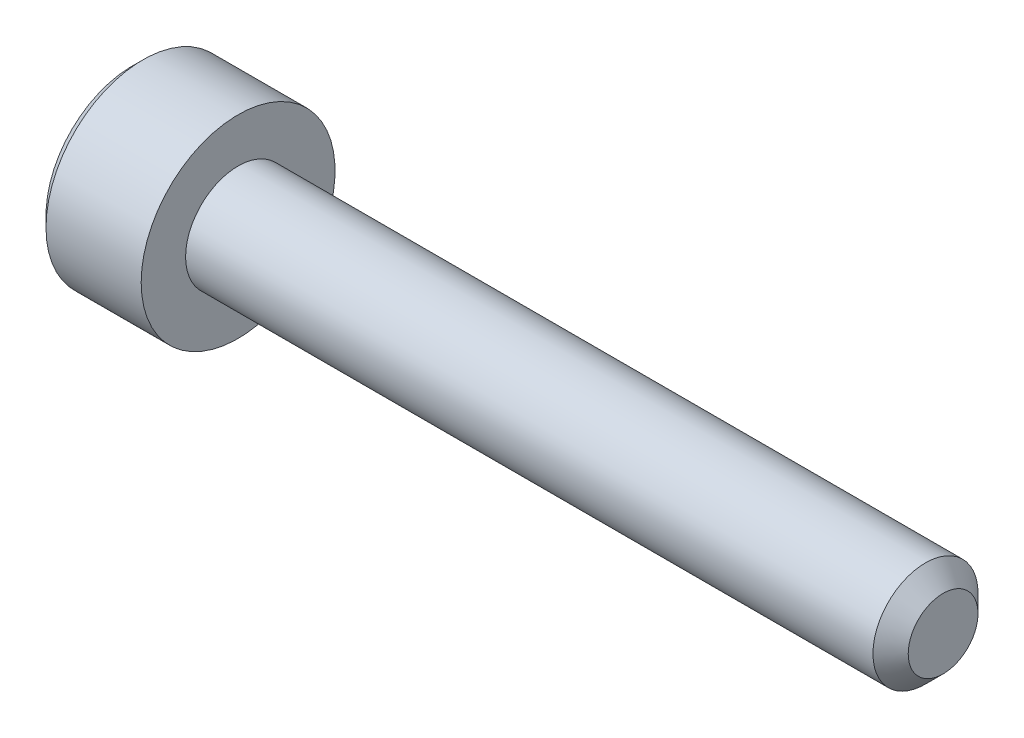
ISO-10303-21;
HEADER;
FILE_DESCRIPTION(('STEP AP214'),'2;1');
FILE_NAME('part.step','',(''),(''),'','','');
FILE_SCHEMA(('AUTOMOTIVE_DESIGN { 1 0 10303 214 1 1 1 1 }'));
ENDSEC;
DATA;
#1=APPLICATION_CONTEXT('core data for automotive mechanical design processes');
#2=APPLICATION_PROTOCOL_DEFINITION('international standard','automotive_design',2000,#1);
#3=PRODUCT_CONTEXT('',#1,'mechanical');
#4=PRODUCT('Part','Part','',(#3));
#5=PRODUCT_RELATED_PRODUCT_CATEGORY('part','',(#4));
#6=PRODUCT_DEFINITION_FORMATION('','',#4);
#7=PRODUCT_DEFINITION_CONTEXT('part definition',#1,'design');
#8=PRODUCT_DEFINITION('design','',#6,#7);
#9=PRODUCT_DEFINITION_SHAPE('','',#8);
#10=(LENGTH_UNIT() NAMED_UNIT(*) SI_UNIT(.MILLI.,.METRE.));
#11=(NAMED_UNIT(*) PLANE_ANGLE_UNIT() SI_UNIT($,.RADIAN.));
#12=(NAMED_UNIT(*) SI_UNIT($,.STERADIAN.) SOLID_ANGLE_UNIT());
#13=UNCERTAINTY_MEASURE_WITH_UNIT(LENGTH_MEASURE(1.E-05),#10,'distance_accuracy_value','');
#14=(GEOMETRIC_REPRESENTATION_CONTEXT(3) GLOBAL_UNCERTAINTY_ASSIGNED_CONTEXT((#13)) GLOBAL_UNIT_ASSIGNED_CONTEXT((#10,
#11,#12)) REPRESENTATION_CONTEXT('',''));
#15=CARTESIAN_POINT('',(0.,0.,0.));
#16=DIRECTION('',(0.,0.,1.));
#17=DIRECTION('',(1.,0.,0.));
#18=AXIS2_PLACEMENT_3D('',#15,#16,#17);
#19=CARTESIAN_POINT('',(0.,0.,0.));
#20=DIRECTION('',(1.,0.,0.));
#21=DIRECTION('',(0.,0.,-1.));
#22=AXIS2_PLACEMENT_3D('',#19,#20,#21);
#23=PLANE('',#22);
#24=DIRECTION('',(0.,0.866025403784439,0.5));
#25=VECTOR('',#24,1.);
#26=CARTESIAN_POINT('',(0.,1.4,-0.981495457622363));
#27=LINE('',#26,#25);
#28=CARTESIAN_POINT('',(0.,0.,-1.78978583448784));
#29=VERTEX_POINT('',#28);
#30=CARTESIAN_POINT('',(0.,1.55,-0.894892917243919));
#31=VERTEX_POINT('',#30);
#32=EDGE_CURVE('E153',#29,#31,#27,.T.);
#33=ORIENTED_EDGE('',*,*,#32,.T.);
#34=DIRECTION('',(0.,0.,1.));
#35=VECTOR('',#34,1.);
#36=CARTESIAN_POINT('',(0.,1.55,0.721687836487032));
#37=LINE('',#36,#35);
#38=CARTESIAN_POINT('',(0.,1.55,0.894892917243921));
#39=VERTEX_POINT('',#38);
#40=EDGE_CURVE('E163',#31,#39,#37,.T.);
#41=ORIENTED_EDGE('',*,*,#40,.T.);
#42=DIRECTION('',(0.,-0.866025403784439,0.5));
#43=VECTOR('',#42,1.);
#44=CARTESIAN_POINT('',(0.,0.150000000000001,1.7031832941094));
#45=LINE('',#44,#43);
#46=CARTESIAN_POINT('',(0.,0.,1.78978583448784));
#47=VERTEX_POINT('',#46);
#48=EDGE_CURVE('E161',#39,#47,#45,.T.);
#49=ORIENTED_EDGE('',*,*,#48,.T.);
#50=DIRECTION('',(0.,-0.866025403784439,-0.5));
#51=VECTOR('',#50,1.);
#52=CARTESIAN_POINT('',(0.,-1.4,0.981495457622366));
#53=LINE('',#52,#51);
#54=CARTESIAN_POINT('',(0.,-1.55,0.894892917243921));
#55=VERTEX_POINT('',#54);
#56=EDGE_CURVE('E159',#47,#55,#53,.T.);
#57=ORIENTED_EDGE('',*,*,#56,.T.);
#58=DIRECTION('',(0.,0.,-1.));
#59=VECTOR('',#58,1.);
#60=CARTESIAN_POINT('',(0.,-1.55,-0.721687836487031));
#61=LINE('',#60,#59);
#62=CARTESIAN_POINT('',(0.,-1.55,-0.89489291724392));
#63=VERTEX_POINT('',#62);
#64=EDGE_CURVE('E157',#55,#63,#61,.T.);
#65=ORIENTED_EDGE('',*,*,#64,.T.);
#66=DIRECTION('',(0.,0.866025403784439,-0.5));
#67=VECTOR('',#66,1.);
#68=CARTESIAN_POINT('',(0.,-0.15,-1.7031832941094));
#69=LINE('',#68,#67);
#70=EDGE_CURVE('E155',#63,#29,#69,.T.);
#71=ORIENTED_EDGE('',*,*,#70,.T.);
#72=EDGE_LOOP('',(#33,#41,#49,#57,#65,#71));
#73=FACE_BOUND('',#72,.T.);
#74=CARTESIAN_POINT('',(0.,0.,0.));
#75=DIRECTION('',(1.,0.,0.));
#76=DIRECTION('',(0.,0.,-1.));
#77=AXIS2_PLACEMENT_3D('',#74,#75,#76);
#78=CIRCLE('',#77,2.45);
#79=CARTESIAN_POINT('',(0.,0.,-2.45));
#80=VERTEX_POINT('',#79);
#81=EDGE_CURVE('E147',#80,#80,#78,.F.);
#82=ORIENTED_EDGE('',*,*,#81,.T.);
#83=EDGE_LOOP('',(#82));
#84=FACE_BOUND('',#83,.T.);
#85=ADVANCED_FACE('F32',(#73,#84),#23,.F.);
#86=CARTESIAN_POINT('',(23.,0.,0.));
#87=DIRECTION('',(-1.,0.,0.));
#88=DIRECTION('',(0.,0.,1.));
#89=AXIS2_PLACEMENT_3D('',#86,#87,#88);
#90=PLANE('',#89);
#91=CARTESIAN_POINT('',(23.,0.,0.));
#92=DIRECTION('',(-1.,0.,0.));
#93=DIRECTION('',(0.,0.,1.));
#94=AXIS2_PLACEMENT_3D('',#91,#92,#93);
#95=CIRCLE('',#94,0.989999999999991);
#96=CARTESIAN_POINT('',(23.,0.,0.989999999999991));
#97=VERTEX_POINT('',#96);
#98=EDGE_CURVE('E144',#97,#97,#95,.F.);
#99=ORIENTED_EDGE('',*,*,#98,.T.);
#100=EDGE_LOOP('',(#99));
#101=FACE_BOUND('',#100,.T.);
#102=ADVANCED_FACE('F243',(#101),#90,.F.);
#103=CARTESIAN_POINT('',(-88.7054908485857,0.,0.));
#104=DIRECTION('',(-1.,0.,0.));
#105=DIRECTION('',(0.,0.,1.));
#106=AXIS2_PLACEMENT_3D('',#103,#104,#105);
#107=CYLINDRICAL_SURFACE('',#106,1.49);
#108=CARTESIAN_POINT('',(22.5,0.,0.));
#109=DIRECTION('',(-1.,0.,0.));
#110=DIRECTION('',(0.,0.,1.));
#111=AXIS2_PLACEMENT_3D('',#108,#109,#110);
#112=CIRCLE('',#111,1.49);
#113=CARTESIAN_POINT('',(22.5,0.,1.49));
#114=VERTEX_POINT('',#113);
#115=EDGE_CURVE('E141',#114,#114,#112,.T.);
#116=ORIENTED_EDGE('',*,*,#115,.T.);
#117=EDGE_LOOP('',(#116));
#118=FACE_BOUND('',#117,.T.);
#119=CARTESIAN_POINT('',(3.,0.,0.));
#120=DIRECTION('',(-1.,0.,0.));
#121=DIRECTION('',(0.,0.,1.));
#122=AXIS2_PLACEMENT_3D('',#119,#120,#121);
#123=CIRCLE('',#122,1.49);
#124=CARTESIAN_POINT('',(3.,0.,1.49));
#125=VERTEX_POINT('',#124);
#126=EDGE_CURVE('E133',#125,#125,#123,.T.);
#127=ORIENTED_EDGE('',*,*,#126,.F.);
#128=EDGE_LOOP('',(#127));
#129=FACE_BOUND('',#128,.T.);
#130=ADVANCED_FACE('F248',(#118,#129),#107,.T.);
#131=CARTESIAN_POINT('',(3.,1.49,0.));
#132=DIRECTION('',(-1.,0.,0.));
#133=DIRECTION('',(0.,0.,1.));
#134=AXIS2_PLACEMENT_3D('',#131,#132,#133);
#135=PLANE('',#134);
#136=CARTESIAN_POINT('',(3.,0.,0.));
#137=DIRECTION('',(-1.,0.,0.));
#138=DIRECTION('',(0.,0.,1.));
#139=AXIS2_PLACEMENT_3D('',#136,#137,#138);
#140=CIRCLE('',#139,2.75);
#141=CARTESIAN_POINT('',(3.,0.,2.75));
#142=VERTEX_POINT('',#141);
#143=EDGE_CURVE('E129',#142,#142,#140,.T.);
#144=ORIENTED_EDGE('',*,*,#143,.F.);
#145=EDGE_LOOP('',(#144));
#146=FACE_BOUND('',#145,.T.);
#147=ORIENTED_EDGE('',*,*,#126,.T.);
#148=EDGE_LOOP('',(#147));
#149=FACE_BOUND('',#148,.T.);
#150=ADVANCED_FACE('F258',(#146,#149),#135,.F.);
#151=CARTESIAN_POINT('',(-88.7054908485857,0.,0.));
#152=DIRECTION('',(-1.,0.,0.));
#153=DIRECTION('',(0.,0.,1.));
#154=AXIS2_PLACEMENT_3D('',#151,#152,#153);
#155=CYLINDRICAL_SURFACE('',#154,2.75);
#156=CARTESIAN_POINT('',(0.300000000000009,0.,0.));
#157=DIRECTION('',(1.,0.,0.));
#158=DIRECTION('',(0.,0.,-1.));
#159=AXIS2_PLACEMENT_3D('',#156,#157,#158);
#160=CIRCLE('',#159,2.75);
#161=CARTESIAN_POINT('',(0.300000000000009,0.,-2.75));
#162=VERTEX_POINT('',#161);
#163=EDGE_CURVE('E150',#162,#162,#160,.T.);
#164=ORIENTED_EDGE('',*,*,#163,.T.);
#165=EDGE_LOOP('',(#164));
#166=FACE_BOUND('',#165,.T.);
#167=ORIENTED_EDGE('',*,*,#143,.T.);
#168=EDGE_LOOP('',(#167));
#169=FACE_BOUND('',#168,.T.);
#170=ADVANCED_FACE('F254',(#166,#169),#155,.T.);
#171=CARTESIAN_POINT('',(22.5,0.,0.));
#172=DIRECTION('',(-1.,0.,0.));
#173=DIRECTION('',(0.,0.,1.));
#174=AXIS2_PLACEMENT_3D('',#171,#172,#173);
#175=CONICAL_SURFACE('',#174,1.49,0.785398163397463);
#176=ORIENTED_EDGE('',*,*,#98,.F.);
#177=EDGE_LOOP('',(#176));
#178=FACE_BOUND('',#177,.T.);
#179=ORIENTED_EDGE('',*,*,#115,.F.);
#180=EDGE_LOOP('',(#179));
#181=FACE_BOUND('',#180,.T.);
#182=ADVANCED_FACE('F257',(#178,#181),#175,.T.);
#183=CARTESIAN_POINT('',(0.,0.,0.));
#184=DIRECTION('',(1.,0.,0.));
#185=DIRECTION('',(0.,0.,-1.));
#186=AXIS2_PLACEMENT_3D('',#183,#184,#185);
#187=CONICAL_SURFACE('',#186,2.45,0.785398163397438);
#188=ORIENTED_EDGE('',*,*,#163,.F.);
#189=EDGE_LOOP('',(#188));
#190=FACE_BOUND('',#189,.T.);
#191=ORIENTED_EDGE('',*,*,#81,.F.);
#192=EDGE_LOOP('',(#191));
#193=FACE_BOUND('',#192,.T.);
#194=ADVANCED_FACE('F268',(#190,#193),#187,.T.);
#195=CARTESIAN_POINT('',(2.5,1.25,0.721687836487032));
#196=DIRECTION('',(0.,-0.5,-0.866025403784438));
#197=DIRECTION('',(0.,0.866025403784439,-0.5));
#198=AXIS2_PLACEMENT_3D('',#195,#196,#197);
#199=PLANE('',#198);
#200=DIRECTION('',(-1.,0.,0.));
#201=VECTOR('',#200,1.);
#202=CARTESIAN_POINT('',(2.5,0.,1.44337567297407));
#203=LINE('',#202,#201);
#204=CARTESIAN_POINT('',(2.5,0.,1.44337567297407));
#205=VERTEX_POINT('',#204);
#206=CARTESIAN_POINT('',(0.299999999999998,0.,1.44337567297407));
#207=VERTEX_POINT('',#206);
#208=EDGE_CURVE('E121',#205,#207,#203,.T.);
#209=ORIENTED_EDGE('',*,*,#208,.T.);
#210=DIRECTION('',(0.,0.866025403784439,-0.5));
#211=VECTOR('',#210,1.);
#212=CARTESIAN_POINT('',(0.299999999999998,1.25,0.721687836487032));
#213=LINE('',#212,#211);
#214=CARTESIAN_POINT('',(0.299999999999998,1.25,0.721687836487032));
#215=VERTEX_POINT('',#214);
#216=EDGE_CURVE('E169',#207,#215,#213,.T.);
#217=ORIENTED_EDGE('',*,*,#216,.T.);
#218=DIRECTION('',(-1.,0.,0.));
#219=VECTOR('',#218,1.);
#220=CARTESIAN_POINT('',(2.5,1.25,0.721687836487032));
#221=LINE('',#220,#219);
#222=CARTESIAN_POINT('',(2.5,1.25,0.721687836487032));
#223=VERTEX_POINT('',#222);
#224=EDGE_CURVE('E124',#223,#215,#221,.T.);
#225=ORIENTED_EDGE('',*,*,#224,.F.);
#226=DIRECTION('',(0.,-0.866025403784439,0.5));
#227=VECTOR('',#226,1.);
#228=CARTESIAN_POINT('',(2.5,1.25,0.721687836487032));
#229=LINE('',#228,#227);
#230=EDGE_CURVE('E109',#223,#205,#229,.T.);
#231=ORIENTED_EDGE('',*,*,#230,.T.);
#232=EDGE_LOOP('',(#209,#217,#225,#231));
#233=FACE_BOUND('',#232,.T.);
#234=ADVANCED_FACE('F120',(#233),#199,.T.);
#235=CARTESIAN_POINT('',(2.5,0.,1.44337567297407));
#236=DIRECTION('',(0.,0.5,-0.866025403784438));
#237=DIRECTION('',(0.,0.866025403784439,0.5));
#238=AXIS2_PLACEMENT_3D('',#235,#236,#237);
#239=PLANE('',#238);
#240=DIRECTION('',(-1.,0.,0.));
#241=VECTOR('',#240,1.);
#242=CARTESIAN_POINT('',(2.5,-1.25,0.721687836487033));
#243=LINE('',#242,#241);
#244=CARTESIAN_POINT('',(2.5,-1.25,0.721687836487033));
#245=VERTEX_POINT('',#244);
#246=CARTESIAN_POINT('',(0.299999999999998,-1.25,0.721687836487033));
#247=VERTEX_POINT('',#246);
#248=EDGE_CURVE('E130',#245,#247,#243,.T.);
#249=ORIENTED_EDGE('',*,*,#248,.T.);
#250=DIRECTION('',(0.,0.866025403784439,0.5));
#251=VECTOR('',#250,1.);
#252=CARTESIAN_POINT('',(0.299999999999998,0.,1.44337567297407));
#253=LINE('',#252,#251);
#254=EDGE_CURVE('E128',#247,#207,#253,.T.);
#255=ORIENTED_EDGE('',*,*,#254,.T.);
#256=ORIENTED_EDGE('',*,*,#208,.F.);
#257=DIRECTION('',(0.,-0.866025403784439,-0.5));
#258=VECTOR('',#257,1.);
#259=CARTESIAN_POINT('',(2.5,0.,1.44337567297407));
#260=LINE('',#259,#258);
#261=EDGE_CURVE('E105',#205,#245,#260,.T.);
#262=ORIENTED_EDGE('',*,*,#261,.T.);
#263=EDGE_LOOP('',(#249,#255,#256,#262));
#264=FACE_BOUND('',#263,.T.);
#265=ADVANCED_FACE('F126',(#264),#239,.T.);
#266=CARTESIAN_POINT('',(2.5,-1.25,0.721687836487033));
#267=DIRECTION('',(0.,1.,0.));
#268=DIRECTION('',(0.,0.,1.));
#269=AXIS2_PLACEMENT_3D('',#266,#267,#268);
#270=PLANE('',#269);
#271=DIRECTION('',(-1.,0.,0.));
#272=VECTOR('',#271,1.);
#273=CARTESIAN_POINT('',(2.5,-1.25,-0.721687836487031));
#274=LINE('',#273,#272);
#275=CARTESIAN_POINT('',(2.5,-1.25,-0.721687836487031));
#276=VERTEX_POINT('',#275);
#277=CARTESIAN_POINT('',(0.299999999999998,-1.25,-0.721687836487031));
#278=VERTEX_POINT('',#277);
#279=EDGE_CURVE('E135',#276,#278,#274,.T.);
#280=ORIENTED_EDGE('',*,*,#279,.T.);
#281=DIRECTION('',(0.,0.,1.));
#282=VECTOR('',#281,1.);
#283=CARTESIAN_POINT('',(0.299999999999998,-1.25,0.721687836487033));
#284=LINE('',#283,#282);
#285=EDGE_CURVE('E172',#278,#247,#284,.T.);
#286=ORIENTED_EDGE('',*,*,#285,.T.);
#287=ORIENTED_EDGE('',*,*,#248,.F.);
#288=DIRECTION('',(0.,0.,-1.));
#289=VECTOR('',#288,1.);
#290=CARTESIAN_POINT('',(2.5,-1.25,0.721687836487033));
#291=LINE('',#290,#289);
#292=EDGE_CURVE('E111',#245,#276,#291,.T.);
#293=ORIENTED_EDGE('',*,*,#292,.T.);
#294=EDGE_LOOP('',(#280,#286,#287,#293));
#295=FACE_BOUND('',#294,.T.);
#296=ADVANCED_FACE('F199',(#295),#270,.T.);
#297=CARTESIAN_POINT('',(2.5,-1.25,-0.721687836487031));
#298=DIRECTION('',(0.,0.5,0.866025403784439));
#299=DIRECTION('',(0.,-0.866025403784439,0.5));
#300=AXIS2_PLACEMENT_3D('',#297,#298,#299);
#301=PLANE('',#300);
#302=DIRECTION('',(-1.,0.,0.));
#303=VECTOR('',#302,1.);
#304=CARTESIAN_POINT('',(2.5,0.,-1.44337567297406));
#305=LINE('',#304,#303);
#306=CARTESIAN_POINT('',(2.5,0.,-1.44337567297406));
#307=VERTEX_POINT('',#306);
#308=CARTESIAN_POINT('',(0.299999999999998,0.,-1.44337567297406));
#309=VERTEX_POINT('',#308);
#310=EDGE_CURVE('E200',#307,#309,#305,.T.);
#311=ORIENTED_EDGE('',*,*,#310,.T.);
#312=DIRECTION('',(0.,-0.866025403784439,0.5));
#313=VECTOR('',#312,1.);
#314=CARTESIAN_POINT('',(0.299999999999998,-1.25,-0.721687836487031));
#315=LINE('',#314,#313);
#316=EDGE_CURVE('E41',#309,#278,#315,.T.);
#317=ORIENTED_EDGE('',*,*,#316,.T.);
#318=ORIENTED_EDGE('',*,*,#279,.F.);
#319=DIRECTION('',(0.,0.866025403784439,-0.499999999999999));
#320=VECTOR('',#319,1.);
#321=CARTESIAN_POINT('',(2.5,-1.25,-0.721687836487031));
#322=LINE('',#321,#320);
#323=EDGE_CURVE('E210',#276,#307,#322,.T.);
#324=ORIENTED_EDGE('',*,*,#323,.T.);
#325=EDGE_LOOP('',(#311,#317,#318,#324));
#326=FACE_BOUND('',#325,.T.);
#327=ADVANCED_FACE('F212',(#326),#301,.T.);
#328=CARTESIAN_POINT('',(2.5,0.,-1.44337567297406));
#329=DIRECTION('',(0.,-0.5,0.866025403784439));
#330=DIRECTION('',(0.,-0.866025403784439,-0.5));
#331=AXIS2_PLACEMENT_3D('',#328,#329,#330);
#332=PLANE('',#331);
#333=DIRECTION('',(-1.,0.,0.));
#334=VECTOR('',#333,1.);
#335=CARTESIAN_POINT('',(2.5,1.25,-0.72168783648703));
#336=LINE('',#335,#334);
#337=CARTESIAN_POINT('',(2.5,1.25,-0.72168783648703));
#338=VERTEX_POINT('',#337);
#339=CARTESIAN_POINT('',(0.299999999999998,1.25,-0.72168783648703));
#340=VERTEX_POINT('',#339);
#341=EDGE_CURVE('E201',#338,#340,#336,.T.);
#342=ORIENTED_EDGE('',*,*,#341,.T.);
#343=DIRECTION('',(0.,-0.866025403784439,-0.5));
#344=VECTOR('',#343,1.);
#345=CARTESIAN_POINT('',(0.299999999999998,0.,-1.44337567297406));
#346=LINE('',#345,#344);
#347=EDGE_CURVE('E11',#340,#309,#346,.T.);
#348=ORIENTED_EDGE('',*,*,#347,.T.);
#349=ORIENTED_EDGE('',*,*,#310,.F.);
#350=DIRECTION('',(0.,0.866025403784438,0.5));
#351=VECTOR('',#350,1.);
#352=CARTESIAN_POINT('',(2.5,0.,-1.44337567297406));
#353=LINE('',#352,#351);
#354=EDGE_CURVE('E208',#307,#338,#353,.T.);
#355=ORIENTED_EDGE('',*,*,#354,.T.);
#356=EDGE_LOOP('',(#342,#348,#349,#355));
#357=FACE_BOUND('',#356,.T.);
#358=ADVANCED_FACE('F214',(#357),#332,.T.);
#359=CARTESIAN_POINT('',(2.5,1.25,-0.72168783648703));
#360=DIRECTION('',(0.,-1.,0.));
#361=DIRECTION('',(0.,0.,-1.));
#362=AXIS2_PLACEMENT_3D('',#359,#360,#361);
#363=PLANE('',#362);
#364=ORIENTED_EDGE('',*,*,#224,.T.);
#365=DIRECTION('',(0.,0.,-1.));
#366=VECTOR('',#365,1.);
#367=CARTESIAN_POINT('',(0.299999999999998,1.25,-0.72168783648703));
#368=LINE('',#367,#366);
#369=EDGE_CURVE('E166',#215,#340,#368,.T.);
#370=ORIENTED_EDGE('',*,*,#369,.T.);
#371=ORIENTED_EDGE('',*,*,#341,.F.);
#372=DIRECTION('',(0.,0.,1.));
#373=VECTOR('',#372,1.);
#374=CARTESIAN_POINT('',(2.5,1.25,-0.72168783648703));
#375=LINE('',#374,#373);
#376=EDGE_CURVE('E206',#338,#223,#375,.T.);
#377=ORIENTED_EDGE('',*,*,#376,.T.);
#378=EDGE_LOOP('',(#364,#370,#371,#377));
#379=FACE_BOUND('',#378,.T.);
#380=ADVANCED_FACE('F217',(#379),#363,.T.);
#381=CARTESIAN_POINT('',(2.5,0.,0.));
#382=DIRECTION('',(1.,0.,0.));
#383=DIRECTION('',(0.,0.,-1.));
#384=AXIS2_PLACEMENT_3D('',#381,#382,#383);
#385=PLANE('',#384);
#386=ORIENTED_EDGE('',*,*,#230,.F.);
#387=ORIENTED_EDGE('',*,*,#376,.F.);
#388=ORIENTED_EDGE('',*,*,#354,.F.);
#389=ORIENTED_EDGE('',*,*,#323,.F.);
#390=ORIENTED_EDGE('',*,*,#292,.F.);
#391=ORIENTED_EDGE('',*,*,#261,.F.);
#392=EDGE_LOOP('',(#386,#387,#388,#389,#390,#391));
#393=FACE_BOUND('',#392,.T.);
#394=ADVANCED_FACE('F107',(#393),#385,.F.);
#395=CARTESIAN_POINT('',(0.,-1.55,0.));
#396=DIRECTION('',(-0.707106781186552,0.707106781186543,0.));
#397=DIRECTION('',(0.,0.,1.));
#398=AXIS2_PLACEMENT_3D('',#395,#396,#397);
#399=PLANE('',#398);
#400=DIRECTION('',(0.654653670707973,0.654653670707981,-0.377964473009229));
#401=VECTOR('',#400,1.);
#402=CARTESIAN_POINT('',(0.221428571428571,-1.32857142857143,0.76705107192336));
#403=LINE('',#402,#401);
#404=EDGE_CURVE('E184',#247,#55,#403,.F.);
#405=ORIENTED_EDGE('',*,*,#404,.F.);
#406=ORIENTED_EDGE('',*,*,#285,.F.);
#407=DIRECTION('',(0.654653670707973,0.654653670707981,0.377964473009229));
#408=VECTOR('',#407,1.);
#409=CARTESIAN_POINT('',(0.221428571428571,-1.32857142857143,-0.767051071923359));
#410=LINE('',#409,#408);
#411=EDGE_CURVE('E36',#63,#278,#410,.T.);
#412=ORIENTED_EDGE('',*,*,#411,.F.);
#413=ORIENTED_EDGE('',*,*,#64,.F.);
#414=EDGE_LOOP('',(#405,#406,#412,#413));
#415=FACE_BOUND('',#414,.T.);
#416=ADVANCED_FACE('F34',(#415),#399,.T.);
#417=CARTESIAN_POINT('',(0.,-0.775,-1.34233937586588));
#418=DIRECTION('',(-0.707106781186552,0.353553390593271,0.612372435695791));
#419=DIRECTION('',(0.,-0.866025403784439,0.5));
#420=AXIS2_PLACEMENT_3D('',#417,#418,#419);
#421=PLANE('',#420);
#422=ORIENTED_EDGE('',*,*,#411,.T.);
#423=ORIENTED_EDGE('',*,*,#316,.F.);
#424=DIRECTION('',(0.654653670707973,0.,0.755928946018458));
#425=VECTOR('',#424,1.);
#426=CARTESIAN_POINT('',(0.221428571428571,0.,-1.53410214384672));
#427=LINE('',#426,#425);
#428=EDGE_CURVE('E182',#29,#309,#427,.T.);
#429=ORIENTED_EDGE('',*,*,#428,.F.);
#430=ORIENTED_EDGE('',*,*,#70,.F.);
#431=EDGE_LOOP('',(#422,#423,#429,#430));
#432=FACE_BOUND('',#431,.T.);
#433=ADVANCED_FACE('F193',(#432),#421,.T.);
#434=CARTESIAN_POINT('',(0.,-0.775000000000002,1.34233937586588));
#435=DIRECTION('',(-0.707106781186552,0.353553390593272,-0.612372435695791));
#436=DIRECTION('',(0.,0.866025403784439,0.5));
#437=AXIS2_PLACEMENT_3D('',#434,#435,#436);
#438=PLANE('',#437);
#439=ORIENTED_EDGE('',*,*,#404,.T.);
#440=ORIENTED_EDGE('',*,*,#56,.F.);
#441=DIRECTION('',(0.654653670707973,0.,-0.755928946018458));
#442=VECTOR('',#441,1.);
#443=CARTESIAN_POINT('',(0.221428571428572,0.,1.53410214384672));
#444=LINE('',#443,#442);
#445=EDGE_CURVE('E179',#207,#47,#444,.F.);
#446=ORIENTED_EDGE('',*,*,#445,.F.);
#447=ORIENTED_EDGE('',*,*,#254,.F.);
#448=EDGE_LOOP('',(#439,#440,#446,#447));
#449=FACE_BOUND('',#448,.T.);
#450=ADVANCED_FACE('F234',(#449),#438,.T.);
#451=CARTESIAN_POINT('',(0.,0.775000000000001,-1.34233937586588));
#452=DIRECTION('',(-0.707106781186552,-0.353553390593272,0.612372435695791));
#453=DIRECTION('',(0.,-0.866025403784439,-0.5));
#454=AXIS2_PLACEMENT_3D('',#451,#452,#453);
#455=PLANE('',#454);
#456=ORIENTED_EDGE('',*,*,#428,.T.);
#457=ORIENTED_EDGE('',*,*,#347,.F.);
#458=DIRECTION('',(-0.654653670707973,0.654653670707981,-0.377964473009229));
#459=VECTOR('',#458,1.);
#460=CARTESIAN_POINT('',(0.221428571428571,1.32857142857143,-0.767051071923358));
#461=LINE('',#460,#459);
#462=EDGE_CURVE('E177',#31,#340,#461,.F.);
#463=ORIENTED_EDGE('',*,*,#462,.F.);
#464=ORIENTED_EDGE('',*,*,#32,.F.);
#465=EDGE_LOOP('',(#456,#457,#463,#464));
#466=FACE_BOUND('',#465,.T.);
#467=ADVANCED_FACE('F232',(#466),#455,.T.);
#468=CARTESIAN_POINT('',(0.,0.775000000000001,1.34233937586588));
#469=DIRECTION('',(-0.707106781186552,-0.353553390593272,-0.612372435695791));
#470=DIRECTION('',(0.,0.866025403784439,-0.5));
#471=AXIS2_PLACEMENT_3D('',#468,#469,#470);
#472=PLANE('',#471);
#473=ORIENTED_EDGE('',*,*,#445,.T.);
#474=ORIENTED_EDGE('',*,*,#48,.F.);
#475=DIRECTION('',(0.654653670707973,-0.654653670707981,-0.377964473009229));
#476=VECTOR('',#475,1.);
#477=CARTESIAN_POINT('',(0.221428571428571,1.32857142857143,0.767051071923359));
#478=LINE('',#477,#476);
#479=EDGE_CURVE('E175',#215,#39,#478,.F.);
#480=ORIENTED_EDGE('',*,*,#479,.F.);
#481=ORIENTED_EDGE('',*,*,#216,.F.);
#482=EDGE_LOOP('',(#473,#474,#480,#481));
#483=FACE_BOUND('',#482,.T.);
#484=ADVANCED_FACE('F227',(#483),#472,.T.);
#485=CARTESIAN_POINT('',(0.,1.55,0.));
#486=DIRECTION('',(-0.707106781186552,-0.707106781186543,0.));
#487=DIRECTION('',(0.,0.,-1.));
#488=AXIS2_PLACEMENT_3D('',#485,#486,#487);
#489=PLANE('',#488);
#490=ORIENTED_EDGE('',*,*,#462,.T.);
#491=ORIENTED_EDGE('',*,*,#369,.F.);
#492=ORIENTED_EDGE('',*,*,#479,.T.);
#493=ORIENTED_EDGE('',*,*,#40,.F.);
#494=EDGE_LOOP('',(#490,#491,#492,#493));
#495=FACE_BOUND('',#494,.T.);
#496=ADVANCED_FACE('F221',(#495),#489,.T.);
#497=CLOSED_SHELL('',(#85,#102,#130,#150,#170,#182,#194,#234,#265,#296,#327,#358,#380,#394,#416,
#433,#450,#467,#484,#496));
#498=MANIFOLD_SOLID_BREP('B2',#497);
#499=ADVANCED_BREP_SHAPE_REPRESENTATION('',(#18,#498),#14);
#500=SHAPE_DEFINITION_REPRESENTATION(#9,#499);
ENDSEC;
END-ISO-10303-21;
